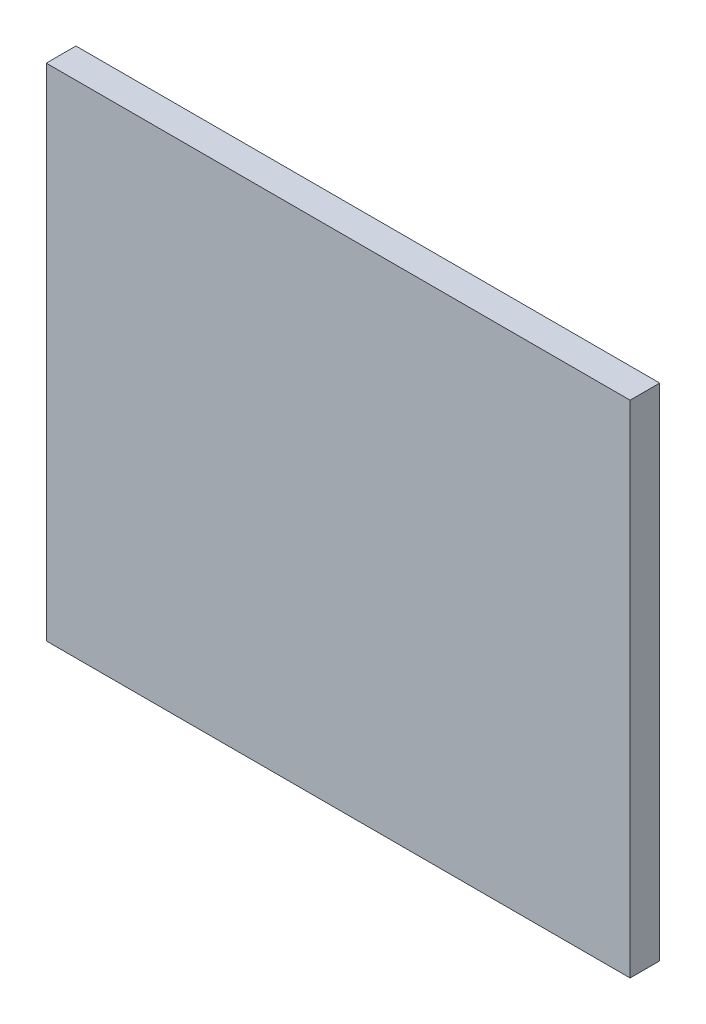
ISO-10303-21;
HEADER;
FILE_DESCRIPTION(('STEP AP214'),'2;1');
FILE_NAME('part.step','',(''),(''),'','','');
FILE_SCHEMA(('AUTOMOTIVE_DESIGN { 1 0 10303 214 1 1 1 1 }'));
ENDSEC;
DATA;
#1=APPLICATION_CONTEXT('core data for automotive mechanical design processes');
#2=APPLICATION_PROTOCOL_DEFINITION('international standard','automotive_design',2000,#1);
#3=PRODUCT_CONTEXT('',#1,'mechanical');
#4=PRODUCT('Part','Part','',(#3));
#5=PRODUCT_RELATED_PRODUCT_CATEGORY('part','',(#4));
#6=PRODUCT_DEFINITION_FORMATION('','',#4);
#7=PRODUCT_DEFINITION_CONTEXT('part definition',#1,'design');
#8=PRODUCT_DEFINITION('design','',#6,#7);
#9=PRODUCT_DEFINITION_SHAPE('','',#8);
#10=(LENGTH_UNIT() NAMED_UNIT(*) SI_UNIT(.MILLI.,.METRE.));
#11=(NAMED_UNIT(*) PLANE_ANGLE_UNIT() SI_UNIT($,.RADIAN.));
#12=(NAMED_UNIT(*) SI_UNIT($,.STERADIAN.) SOLID_ANGLE_UNIT());
#13=UNCERTAINTY_MEASURE_WITH_UNIT(LENGTH_MEASURE(1.E-05),#10,'distance_accuracy_value','');
#14=(GEOMETRIC_REPRESENTATION_CONTEXT(3) GLOBAL_UNCERTAINTY_ASSIGNED_CONTEXT((#13)) GLOBAL_UNIT_ASSIGNED_CONTEXT((#10,
#11,#12)) REPRESENTATION_CONTEXT('',''));
#15=CARTESIAN_POINT('',(0.,0.,0.));
#16=DIRECTION('',(0.,0.,1.));
#17=DIRECTION('',(1.,0.,0.));
#18=AXIS2_PLACEMENT_3D('',#15,#16,#17);
#19=CARTESIAN_POINT('',(99.7170028686523,84.4869995117188,0.));
#20=DIRECTION('',(0.,-1.,0.));
#21=DIRECTION('',(-1.,0.,0.));
#22=AXIS2_PLACEMENT_3D('',#19,#20,#21);
#23=PLANE('',#22);
#24=DIRECTION('',(-1.,0.,0.));
#25=VECTOR('',#24,1.);
#26=CARTESIAN_POINT('',(99.7170028686523,84.4869995117188,0.03556));
#27=LINE('',#26,#25);
#28=CARTESIAN_POINT('',(99.7170028686523,84.4869995117188,0.03556));
#29=VERTEX_POINT('',#28);
#30=CARTESIAN_POINT('',(99.0169982910156,84.4869995117188,0.03556));
#31=VERTEX_POINT('',#30);
#32=EDGE_CURVE('E11',#29,#31,#27,.T.);
#33=ORIENTED_EDGE('',*,*,#32,.F.);
#34=DIRECTION('',(0.,0.,1.));
#35=VECTOR('',#34,1.);
#36=CARTESIAN_POINT('',(99.7170028686523,84.4869995117188,0.));
#37=LINE('',#36,#35);
#38=CARTESIAN_POINT('',(99.7170028686523,84.4869995117188,0.));
#39=VERTEX_POINT('',#38);
#40=EDGE_CURVE('E24',#39,#29,#37,.T.);
#41=ORIENTED_EDGE('',*,*,#40,.F.);
#42=DIRECTION('',(-1.,0.,0.));
#43=VECTOR('',#42,1.);
#44=CARTESIAN_POINT('',(99.7170028686523,84.4869995117188,0.));
#45=LINE('',#44,#43);
#46=CARTESIAN_POINT('',(99.0169982910156,84.4869995117188,0.));
#47=VERTEX_POINT('',#46);
#48=EDGE_CURVE('E75',#39,#47,#45,.T.);
#49=ORIENTED_EDGE('',*,*,#48,.T.);
#50=DIRECTION('',(0.,0.,1.));
#51=VECTOR('',#50,1.);
#52=CARTESIAN_POINT('',(99.0169982910156,84.4869995117188,0.));
#53=LINE('',#52,#51);
#54=EDGE_CURVE('E37',#47,#31,#53,.T.);
#55=ORIENTED_EDGE('',*,*,#54,.T.);
#56=EDGE_LOOP('',(#33,#41,#49,#55));
#57=FACE_BOUND('',#56,.T.);
#58=ADVANCED_FACE('F17',(#57),#23,.F.);
#59=CARTESIAN_POINT('',(99.0169982910156,84.4869995117188,0.));
#60=DIRECTION('',(1.,0.,0.));
#61=DIRECTION('',(0.,-1.,0.));
#62=AXIS2_PLACEMENT_3D('',#59,#60,#61);
#63=PLANE('',#62);
#64=DIRECTION('',(0.,-1.,0.));
#65=VECTOR('',#64,1.);
#66=CARTESIAN_POINT('',(99.0169982910156,84.4869995117188,0.03556));
#67=LINE('',#66,#65);
#68=CARTESIAN_POINT('',(99.0169982910156,83.8870010375977,0.03556));
#69=VERTEX_POINT('',#68);
#70=EDGE_CURVE('E83',#31,#69,#67,.T.);
#71=ORIENTED_EDGE('',*,*,#70,.F.);
#72=ORIENTED_EDGE('',*,*,#54,.F.);
#73=DIRECTION('',(0.,-1.,0.));
#74=VECTOR('',#73,1.);
#75=CARTESIAN_POINT('',(99.0169982910156,84.4869995117188,0.));
#76=LINE('',#75,#74);
#77=CARTESIAN_POINT('',(99.0169982910156,83.8870010375977,0.));
#78=VERTEX_POINT('',#77);
#79=EDGE_CURVE('E81',#47,#78,#76,.T.);
#80=ORIENTED_EDGE('',*,*,#79,.T.);
#81=DIRECTION('',(0.,0.,1.));
#82=VECTOR('',#81,1.);
#83=CARTESIAN_POINT('',(99.0169982910156,83.8870010375977,0.));
#84=LINE('',#83,#82);
#85=EDGE_CURVE('E67',#78,#69,#84,.T.);
#86=ORIENTED_EDGE('',*,*,#85,.T.);
#87=EDGE_LOOP('',(#71,#72,#80,#86));
#88=FACE_BOUND('',#87,.T.);
#89=ADVANCED_FACE('F89',(#88),#63,.F.);
#90=CARTESIAN_POINT('',(99.0169982910156,83.8870010375977,0.));
#91=DIRECTION('',(0.,1.,0.));
#92=DIRECTION('',(1.,0.,0.));
#93=AXIS2_PLACEMENT_3D('',#90,#91,#92);
#94=PLANE('',#93);
#95=DIRECTION('',(1.,0.,0.));
#96=VECTOR('',#95,1.);
#97=CARTESIAN_POINT('',(99.0169982910156,83.8870010375977,0.03556));
#98=LINE('',#97,#96);
#99=CARTESIAN_POINT('',(99.7170028686523,83.8870010375977,0.03556));
#100=VERTEX_POINT('',#99);
#101=EDGE_CURVE('E71',#69,#100,#98,.T.);
#102=ORIENTED_EDGE('',*,*,#101,.F.);
#103=ORIENTED_EDGE('',*,*,#85,.F.);
#104=DIRECTION('',(1.,0.,0.));
#105=VECTOR('',#104,1.);
#106=CARTESIAN_POINT('',(99.0169982910156,83.8870010375977,0.));
#107=LINE('',#106,#105);
#108=CARTESIAN_POINT('',(99.7170028686523,83.8870010375977,0.));
#109=VERTEX_POINT('',#108);
#110=EDGE_CURVE('E63',#78,#109,#107,.T.);
#111=ORIENTED_EDGE('',*,*,#110,.T.);
#112=DIRECTION('',(0.,0.,1.));
#113=VECTOR('',#112,1.);
#114=CARTESIAN_POINT('',(99.7170028686523,83.8870010375977,0.));
#115=LINE('',#114,#113);
#116=EDGE_CURVE('E53',#109,#100,#115,.T.);
#117=ORIENTED_EDGE('',*,*,#116,.T.);
#118=EDGE_LOOP('',(#102,#103,#111,#117));
#119=FACE_BOUND('',#118,.T.);
#120=ADVANCED_FACE('F66',(#119),#94,.F.);
#121=CARTESIAN_POINT('',(99.7170028686523,83.8870010375977,0.));
#122=DIRECTION('',(-1.,0.,0.));
#123=DIRECTION('',(0.,1.,0.));
#124=AXIS2_PLACEMENT_3D('',#121,#122,#123);
#125=PLANE('',#124);
#126=DIRECTION('',(0.,1.,0.));
#127=VECTOR('',#126,1.);
#128=CARTESIAN_POINT('',(99.7170028686523,83.8870010375977,0.03556));
#129=LINE('',#128,#127);
#130=EDGE_CURVE('E59',#100,#29,#129,.T.);
#131=ORIENTED_EDGE('',*,*,#130,.F.);
#132=ORIENTED_EDGE('',*,*,#116,.F.);
#133=DIRECTION('',(0.,1.,0.));
#134=VECTOR('',#133,1.);
#135=CARTESIAN_POINT('',(99.7170028686523,83.8870010375977,0.));
#136=LINE('',#135,#134);
#137=EDGE_CURVE('E57',#109,#39,#136,.T.);
#138=ORIENTED_EDGE('',*,*,#137,.T.);
#139=ORIENTED_EDGE('',*,*,#40,.T.);
#140=EDGE_LOOP('',(#131,#132,#138,#139));
#141=FACE_BOUND('',#140,.T.);
#142=ADVANCED_FACE('F55',(#141),#125,.F.);
#143=CARTESIAN_POINT('',(99.7170028686523,84.4869995117188,0.));
#144=DIRECTION('',(0.,0.,-1.));
#145=DIRECTION('',(-1.,0.,0.));
#146=AXIS2_PLACEMENT_3D('',#143,#144,#145);
#147=PLANE('',#146);
#148=ORIENTED_EDGE('',*,*,#137,.F.);
#149=ORIENTED_EDGE('',*,*,#110,.F.);
#150=ORIENTED_EDGE('',*,*,#79,.F.);
#151=ORIENTED_EDGE('',*,*,#48,.F.);
#152=EDGE_LOOP('',(#148,#149,#150,#151));
#153=FACE_BOUND('',#152,.T.);
#154=ADVANCED_FACE('F74',(#153),#147,.T.);
#155=CARTESIAN_POINT('',(99.7170028686523,84.4869995117188,0.03556));
#156=DIRECTION('',(0.,0.,-1.));
#157=DIRECTION('',(-1.,0.,0.));
#158=AXIS2_PLACEMENT_3D('',#155,#156,#157);
#159=PLANE('',#158);
#160=ORIENTED_EDGE('',*,*,#32,.T.);
#161=ORIENTED_EDGE('',*,*,#70,.T.);
#162=ORIENTED_EDGE('',*,*,#101,.T.);
#163=ORIENTED_EDGE('',*,*,#130,.T.);
#164=EDGE_LOOP('',(#160,#161,#162,#163));
#165=FACE_BOUND('',#164,.T.);
#166=ADVANCED_FACE('F91',(#165),#159,.F.);
#167=CLOSED_SHELL('',(#58,#89,#120,#142,#154,#166));
#168=MANIFOLD_SOLID_BREP('B1',#167);
#169=ADVANCED_BREP_SHAPE_REPRESENTATION('',(#18,#168),#14);
#170=SHAPE_DEFINITION_REPRESENTATION(#9,#169);
ENDSEC;
END-ISO-10303-21;
